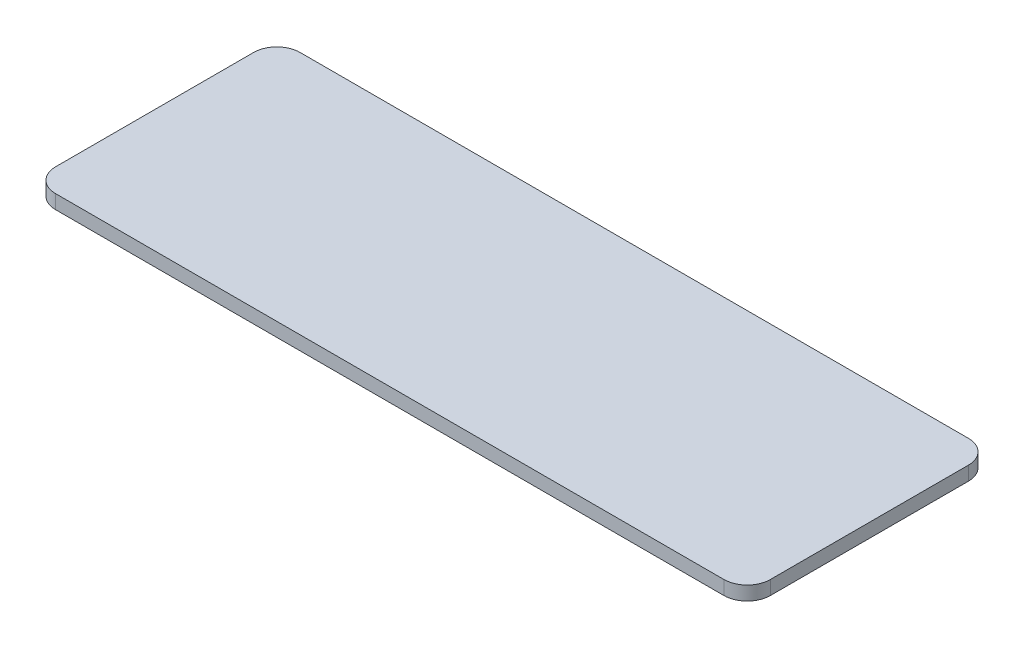
ISO-10303-21;
HEADER;
FILE_DESCRIPTION(('STEP AP214'),'2;1');
FILE_NAME('part.step','',(''),(''),'','','');
FILE_SCHEMA(('AUTOMOTIVE_DESIGN { 1 0 10303 214 1 1 1 1 }'));
ENDSEC;
DATA;
#1=APPLICATION_CONTEXT('core data for automotive mechanical design processes');
#2=APPLICATION_PROTOCOL_DEFINITION('international standard','automotive_design',2000,#1);
#3=PRODUCT_CONTEXT('',#1,'mechanical');
#4=PRODUCT('Part','Part','',(#3));
#5=PRODUCT_RELATED_PRODUCT_CATEGORY('part','',(#4));
#6=PRODUCT_DEFINITION_FORMATION('','',#4);
#7=PRODUCT_DEFINITION_CONTEXT('part definition',#1,'design');
#8=PRODUCT_DEFINITION('design','',#6,#7);
#9=PRODUCT_DEFINITION_SHAPE('','',#8);
#10=(LENGTH_UNIT() NAMED_UNIT(*) SI_UNIT(.MILLI.,.METRE.));
#11=(NAMED_UNIT(*) PLANE_ANGLE_UNIT() SI_UNIT($,.RADIAN.));
#12=(NAMED_UNIT(*) SI_UNIT($,.STERADIAN.) SOLID_ANGLE_UNIT());
#13=UNCERTAINTY_MEASURE_WITH_UNIT(LENGTH_MEASURE(1.E-05),#10,'distance_accuracy_value','');
#14=(GEOMETRIC_REPRESENTATION_CONTEXT(3) GLOBAL_UNCERTAINTY_ASSIGNED_CONTEXT((#13)) GLOBAL_UNIT_ASSIGNED_CONTEXT((#10,
#11,#12)) REPRESENTATION_CONTEXT('',''));
#15=CARTESIAN_POINT('',(0.,0.,0.));
#16=DIRECTION('',(0.,0.,1.));
#17=DIRECTION('',(1.,0.,0.));
#18=AXIS2_PLACEMENT_3D('',#15,#16,#17);
#19=CARTESIAN_POINT('',(36.,1.5,-10.67));
#20=DIRECTION('',(0.,-1.,0.));
#21=DIRECTION('',(0.,0.,-1.));
#22=AXIS2_PLACEMENT_3D('',#19,#20,#21);
#23=CYLINDRICAL_SURFACE('',#22,2.5);
#24=CARTESIAN_POINT('',(36.,0.,-10.67));
#25=DIRECTION('',(0.,1.,0.));
#26=DIRECTION('',(0.,0.,-1.));
#27=AXIS2_PLACEMENT_3D('',#24,#25,#26);
#28=CIRCLE('',#27,2.5);
#29=CARTESIAN_POINT('',(38.5,0.,-10.67));
#30=VERTEX_POINT('',#29);
#31=CARTESIAN_POINT('',(36.,0.,-13.17));
#32=VERTEX_POINT('',#31);
#33=EDGE_CURVE('E135',#30,#32,#28,.T.);
#34=ORIENTED_EDGE('',*,*,#33,.T.);
#35=DIRECTION('',(0.,-1.,0.));
#36=VECTOR('',#35,1.);
#37=CARTESIAN_POINT('',(36.,1.5,-13.17));
#38=LINE('',#37,#36);
#39=CARTESIAN_POINT('',(36.,1.5,-13.17));
#40=VERTEX_POINT('',#39);
#41=EDGE_CURVE('E11',#40,#32,#38,.T.);
#42=ORIENTED_EDGE('',*,*,#41,.F.);
#43=CARTESIAN_POINT('',(36.,1.5,-10.67));
#44=DIRECTION('',(0.,1.,0.));
#45=DIRECTION('',(0.,0.,-1.));
#46=AXIS2_PLACEMENT_3D('',#43,#44,#45);
#47=CIRCLE('',#46,2.5);
#48=CARTESIAN_POINT('',(38.5,1.5,-10.67));
#49=VERTEX_POINT('',#48);
#50=EDGE_CURVE('E149',#49,#40,#47,.T.);
#51=ORIENTED_EDGE('',*,*,#50,.F.);
#52=DIRECTION('',(0.,-1.,0.));
#53=VECTOR('',#52,1.);
#54=CARTESIAN_POINT('',(38.5,1.5,-10.67));
#55=LINE('',#54,#53);
#56=EDGE_CURVE('E131',#49,#30,#55,.T.);
#57=ORIENTED_EDGE('',*,*,#56,.T.);
#58=EDGE_LOOP('',(#34,#42,#51,#57));
#59=FACE_BOUND('',#58,.T.);
#60=ADVANCED_FACE('F39',(#59),#23,.T.);
#61=CARTESIAN_POINT('',(-36.,1.5,-13.17));
#62=DIRECTION('',(0.,0.,1.));
#63=DIRECTION('',(1.,0.,0.));
#64=AXIS2_PLACEMENT_3D('',#61,#62,#63);
#65=PLANE('',#64);
#66=DIRECTION('',(-1.,0.,0.));
#67=VECTOR('',#66,1.);
#68=CARTESIAN_POINT('',(-36.,0.,-13.17));
#69=LINE('',#68,#67);
#70=CARTESIAN_POINT('',(-36.,0.,-13.17));
#71=VERTEX_POINT('',#70);
#72=EDGE_CURVE('E138',#32,#71,#69,.T.);
#73=ORIENTED_EDGE('',*,*,#72,.T.);
#74=DIRECTION('',(0.,-1.,0.));
#75=VECTOR('',#74,1.);
#76=CARTESIAN_POINT('',(-36.,1.5,-13.17));
#77=LINE('',#76,#75);
#78=CARTESIAN_POINT('',(-36.,1.5,-13.17));
#79=VERTEX_POINT('',#78);
#80=EDGE_CURVE('E47',#79,#71,#77,.T.);
#81=ORIENTED_EDGE('',*,*,#80,.F.);
#82=DIRECTION('',(-1.,0.,0.));
#83=VECTOR('',#82,1.);
#84=CARTESIAN_POINT('',(-36.,1.5,-13.17));
#85=LINE('',#84,#83);
#86=EDGE_CURVE('E98',#40,#79,#85,.T.);
#87=ORIENTED_EDGE('',*,*,#86,.F.);
#88=ORIENTED_EDGE('',*,*,#41,.T.);
#89=EDGE_LOOP('',(#73,#81,#87,#88));
#90=FACE_BOUND('',#89,.T.);
#91=ADVANCED_FACE('F184',(#90),#65,.F.);
#92=CARTESIAN_POINT('',(-36.,1.5,-10.67));
#93=DIRECTION('',(0.,-1.,0.));
#94=DIRECTION('',(0.,0.,-1.));
#95=AXIS2_PLACEMENT_3D('',#92,#93,#94);
#96=CYLINDRICAL_SURFACE('',#95,2.5);
#97=CARTESIAN_POINT('',(-36.,0.,-10.67));
#98=DIRECTION('',(0.,1.,0.));
#99=DIRECTION('',(0.,0.,-1.));
#100=AXIS2_PLACEMENT_3D('',#97,#98,#99);
#101=CIRCLE('',#100,2.5);
#102=CARTESIAN_POINT('',(-38.5,0.,-10.67));
#103=VERTEX_POINT('',#102);
#104=EDGE_CURVE('E140',#71,#103,#101,.T.);
#105=ORIENTED_EDGE('',*,*,#104,.T.);
#106=DIRECTION('',(0.,-1.,0.));
#107=VECTOR('',#106,1.);
#108=CARTESIAN_POINT('',(-38.5,1.5,-10.67));
#109=LINE('',#108,#107);
#110=CARTESIAN_POINT('',(-38.5,1.5,-10.67));
#111=VERTEX_POINT('',#110);
#112=EDGE_CURVE('E156',#111,#103,#109,.T.);
#113=ORIENTED_EDGE('',*,*,#112,.F.);
#114=CARTESIAN_POINT('',(-36.,1.5,-10.67));
#115=DIRECTION('',(0.,1.,0.));
#116=DIRECTION('',(0.,0.,-1.));
#117=AXIS2_PLACEMENT_3D('',#114,#115,#116);
#118=CIRCLE('',#117,2.5);
#119=EDGE_CURVE('E164',#79,#111,#118,.T.);
#120=ORIENTED_EDGE('',*,*,#119,.F.);
#121=ORIENTED_EDGE('',*,*,#80,.T.);
#122=EDGE_LOOP('',(#105,#113,#120,#121));
#123=FACE_BOUND('',#122,.T.);
#124=ADVANCED_FACE('F162',(#123),#96,.T.);
#125=CARTESIAN_POINT('',(-38.5,1.5,10.67));
#126=DIRECTION('',(1.,0.,0.));
#127=DIRECTION('',(0.,0.,-1.));
#128=AXIS2_PLACEMENT_3D('',#125,#126,#127);
#129=PLANE('',#128);
#130=DIRECTION('',(0.,0.,1.));
#131=VECTOR('',#130,1.);
#132=CARTESIAN_POINT('',(-38.5,0.,10.67));
#133=LINE('',#132,#131);
#134=CARTESIAN_POINT('',(-38.5,0.,10.67));
#135=VERTEX_POINT('',#134);
#136=EDGE_CURVE('E142',#103,#135,#133,.T.);
#137=ORIENTED_EDGE('',*,*,#136,.T.);
#138=DIRECTION('',(0.,-1.,0.));
#139=VECTOR('',#138,1.);
#140=CARTESIAN_POINT('',(-38.5,1.5,10.67));
#141=LINE('',#140,#139);
#142=CARTESIAN_POINT('',(-38.5,1.5,10.67));
#143=VERTEX_POINT('',#142);
#144=EDGE_CURVE('E153',#143,#135,#141,.T.);
#145=ORIENTED_EDGE('',*,*,#144,.F.);
#146=DIRECTION('',(0.,0.,1.));
#147=VECTOR('',#146,1.);
#148=CARTESIAN_POINT('',(-38.5,1.5,10.67));
#149=LINE('',#148,#147);
#150=EDGE_CURVE('E176',#111,#143,#149,.T.);
#151=ORIENTED_EDGE('',*,*,#150,.F.);
#152=ORIENTED_EDGE('',*,*,#112,.T.);
#153=EDGE_LOOP('',(#137,#145,#151,#152));
#154=FACE_BOUND('',#153,.T.);
#155=ADVANCED_FACE('F172',(#154),#129,.F.);
#156=CARTESIAN_POINT('',(-36.,1.5,10.67));
#157=DIRECTION('',(0.,-1.,0.));
#158=DIRECTION('',(0.,0.,-1.));
#159=AXIS2_PLACEMENT_3D('',#156,#157,#158);
#160=CYLINDRICAL_SURFACE('',#159,2.5);
#161=CARTESIAN_POINT('',(-36.,0.,10.67));
#162=DIRECTION('',(0.,1.,0.));
#163=DIRECTION('',(0.,0.,-1.));
#164=AXIS2_PLACEMENT_3D('',#161,#162,#163);
#165=CIRCLE('',#164,2.5);
#166=CARTESIAN_POINT('',(-36.,0.,13.17));
#167=VERTEX_POINT('',#166);
#168=EDGE_CURVE('E144',#135,#167,#165,.T.);
#169=ORIENTED_EDGE('',*,*,#168,.T.);
#170=DIRECTION('',(0.,-1.,0.));
#171=VECTOR('',#170,1.);
#172=CARTESIAN_POINT('',(-36.,1.5,13.17));
#173=LINE('',#172,#171);
#174=CARTESIAN_POINT('',(-36.,1.5,13.17));
#175=VERTEX_POINT('',#174);
#176=EDGE_CURVE('E126',#175,#167,#173,.T.);
#177=ORIENTED_EDGE('',*,*,#176,.F.);
#178=CARTESIAN_POINT('',(-36.,1.5,10.67));
#179=DIRECTION('',(0.,1.,0.));
#180=DIRECTION('',(0.,0.,-1.));
#181=AXIS2_PLACEMENT_3D('',#178,#179,#180);
#182=CIRCLE('',#181,2.5);
#183=EDGE_CURVE('E117',#143,#175,#182,.T.);
#184=ORIENTED_EDGE('',*,*,#183,.F.);
#185=ORIENTED_EDGE('',*,*,#144,.T.);
#186=EDGE_LOOP('',(#169,#177,#184,#185));
#187=FACE_BOUND('',#186,.T.);
#188=ADVANCED_FACE('F175',(#187),#160,.T.);
#189=CARTESIAN_POINT('',(-36.,1.5,13.17));
#190=DIRECTION('',(0.,0.,-1.));
#191=DIRECTION('',(-1.,0.,0.));
#192=AXIS2_PLACEMENT_3D('',#189,#190,#191);
#193=PLANE('',#192);
#194=DIRECTION('',(1.,0.,0.));
#195=VECTOR('',#194,1.);
#196=CARTESIAN_POINT('',(-36.,0.,13.17));
#197=LINE('',#196,#195);
#198=CARTESIAN_POINT('',(36.,0.,13.17));
#199=VERTEX_POINT('',#198);
#200=EDGE_CURVE('E125',#167,#199,#197,.T.);
#201=ORIENTED_EDGE('',*,*,#200,.T.);
#202=DIRECTION('',(0.,-1.,0.));
#203=VECTOR('',#202,1.);
#204=CARTESIAN_POINT('',(36.,1.5,13.17));
#205=LINE('',#204,#203);
#206=CARTESIAN_POINT('',(36.,1.5,13.17));
#207=VERTEX_POINT('',#206);
#208=EDGE_CURVE('E122',#207,#199,#205,.T.);
#209=ORIENTED_EDGE('',*,*,#208,.F.);
#210=DIRECTION('',(1.,0.,0.));
#211=VECTOR('',#210,1.);
#212=CARTESIAN_POINT('',(-36.,1.5,13.17));
#213=LINE('',#212,#211);
#214=EDGE_CURVE('E111',#175,#207,#213,.T.);
#215=ORIENTED_EDGE('',*,*,#214,.F.);
#216=ORIENTED_EDGE('',*,*,#176,.T.);
#217=EDGE_LOOP('',(#201,#209,#215,#216));
#218=FACE_BOUND('',#217,.T.);
#219=ADVANCED_FACE('F123',(#218),#193,.F.);
#220=CARTESIAN_POINT('',(36.,1.5,10.67));
#221=DIRECTION('',(0.,-1.,0.));
#222=DIRECTION('',(0.,0.,-1.));
#223=AXIS2_PLACEMENT_3D('',#220,#221,#222);
#224=CYLINDRICAL_SURFACE('',#223,2.5);
#225=CARTESIAN_POINT('',(36.,0.,10.67));
#226=DIRECTION('',(0.,1.,0.));
#227=DIRECTION('',(0.,0.,1.));
#228=AXIS2_PLACEMENT_3D('',#225,#226,#227);
#229=CIRCLE('',#228,2.5);
#230=CARTESIAN_POINT('',(38.5,0.,10.67));
#231=VERTEX_POINT('',#230);
#232=EDGE_CURVE('E84',#199,#231,#229,.T.);
#233=ORIENTED_EDGE('',*,*,#232,.T.);
#234=DIRECTION('',(0.,-1.,0.));
#235=VECTOR('',#234,1.);
#236=CARTESIAN_POINT('',(38.5,1.5,10.67));
#237=LINE('',#236,#235);
#238=CARTESIAN_POINT('',(38.5,1.5,10.67));
#239=VERTEX_POINT('',#238);
#240=EDGE_CURVE('E127',#239,#231,#237,.T.);
#241=ORIENTED_EDGE('',*,*,#240,.F.);
#242=CARTESIAN_POINT('',(36.,1.5,10.67));
#243=DIRECTION('',(0.,1.,0.));
#244=DIRECTION('',(0.,0.,1.));
#245=AXIS2_PLACEMENT_3D('',#242,#243,#244);
#246=CIRCLE('',#245,2.5);
#247=EDGE_CURVE('E115',#207,#239,#246,.T.);
#248=ORIENTED_EDGE('',*,*,#247,.F.);
#249=ORIENTED_EDGE('',*,*,#208,.T.);
#250=EDGE_LOOP('',(#233,#241,#248,#249));
#251=FACE_BOUND('',#250,.T.);
#252=ADVANCED_FACE('F129',(#251),#224,.T.);
#253=CARTESIAN_POINT('',(38.5,1.5,10.67));
#254=DIRECTION('',(-1.,0.,0.));
#255=DIRECTION('',(0.,0.,1.));
#256=AXIS2_PLACEMENT_3D('',#253,#254,#255);
#257=PLANE('',#256);
#258=DIRECTION('',(0.,0.,-1.));
#259=VECTOR('',#258,1.);
#260=CARTESIAN_POINT('',(38.5,0.,10.67));
#261=LINE('',#260,#259);
#262=EDGE_CURVE('E90',#231,#30,#261,.T.);
#263=ORIENTED_EDGE('',*,*,#262,.T.);
#264=ORIENTED_EDGE('',*,*,#56,.F.);
#265=DIRECTION('',(0.,0.,-1.));
#266=VECTOR('',#265,1.);
#267=CARTESIAN_POINT('',(38.5,1.5,10.67));
#268=LINE('',#267,#266);
#269=EDGE_CURVE('E55',#239,#49,#268,.T.);
#270=ORIENTED_EDGE('',*,*,#269,.F.);
#271=ORIENTED_EDGE('',*,*,#240,.T.);
#272=EDGE_LOOP('',(#263,#264,#270,#271));
#273=FACE_BOUND('',#272,.T.);
#274=ADVANCED_FACE('F200',(#273),#257,.F.);
#275=CARTESIAN_POINT('',(36.,1.5,-10.67));
#276=DIRECTION('',(0.,-1.,0.));
#277=DIRECTION('',(0.,0.,-1.));
#278=AXIS2_PLACEMENT_3D('',#275,#276,#277);
#279=PLANE('',#278);
#280=ORIENTED_EDGE('',*,*,#50,.T.);
#281=ORIENTED_EDGE('',*,*,#86,.T.);
#282=ORIENTED_EDGE('',*,*,#119,.T.);
#283=ORIENTED_EDGE('',*,*,#150,.T.);
#284=ORIENTED_EDGE('',*,*,#183,.T.);
#285=ORIENTED_EDGE('',*,*,#214,.T.);
#286=ORIENTED_EDGE('',*,*,#247,.T.);
#287=ORIENTED_EDGE('',*,*,#269,.T.);
#288=EDGE_LOOP('',(#280,#281,#282,#283,#284,#285,#286,#287));
#289=FACE_BOUND('',#288,.T.);
#290=ADVANCED_FACE('F113',(#289),#279,.F.);
#291=CARTESIAN_POINT('',(36.,0.,-10.67));
#292=DIRECTION('',(0.,-1.,0.));
#293=DIRECTION('',(0.,0.,-1.));
#294=AXIS2_PLACEMENT_3D('',#291,#292,#293);
#295=PLANE('',#294);
#296=ORIENTED_EDGE('',*,*,#33,.F.);
#297=ORIENTED_EDGE('',*,*,#262,.F.);
#298=ORIENTED_EDGE('',*,*,#232,.F.);
#299=ORIENTED_EDGE('',*,*,#200,.F.);
#300=ORIENTED_EDGE('',*,*,#168,.F.);
#301=ORIENTED_EDGE('',*,*,#136,.F.);
#302=ORIENTED_EDGE('',*,*,#104,.F.);
#303=ORIENTED_EDGE('',*,*,#72,.F.);
#304=EDGE_LOOP('',(#296,#297,#298,#299,#300,#301,#302,#303));
#305=FACE_BOUND('',#304,.T.);
#306=ADVANCED_FACE('F168',(#305),#295,.T.);
#307=CLOSED_SHELL('',(#60,#91,#124,#155,#188,#219,#252,#274,#290,#306));
#308=MANIFOLD_SOLID_BREP('B2',#307);
#309=ADVANCED_BREP_SHAPE_REPRESENTATION('',(#18,#308),#14);
#310=SHAPE_DEFINITION_REPRESENTATION(#9,#309);
ENDSEC;
END-ISO-10303-21;
